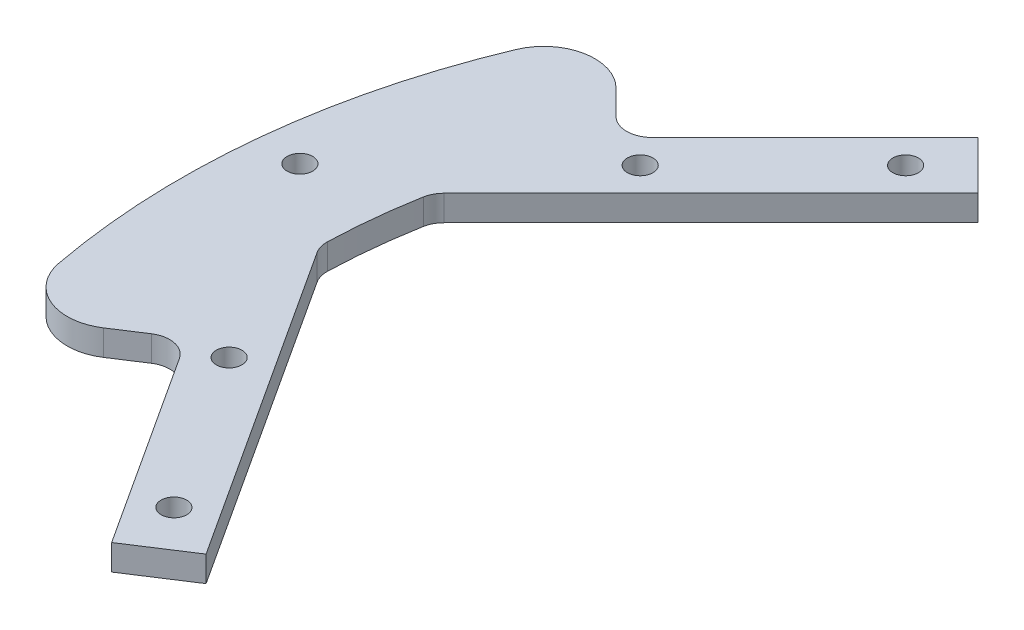
ISO-10303-21;
HEADER;
FILE_DESCRIPTION(('STEP AP214'),'2;1');
FILE_NAME('part.step','',(''),(''),'','','');
FILE_SCHEMA(('AUTOMOTIVE_DESIGN { 1 0 10303 214 1 1 1 1 }'));
ENDSEC;
DATA;
#1=APPLICATION_CONTEXT('core data for automotive mechanical design processes');
#2=APPLICATION_PROTOCOL_DEFINITION('international standard','automotive_design',2000,#1);
#3=PRODUCT_CONTEXT('',#1,'mechanical');
#4=PRODUCT('Part','Part','',(#3));
#5=PRODUCT_RELATED_PRODUCT_CATEGORY('part','',(#4));
#6=PRODUCT_DEFINITION_FORMATION('','',#4);
#7=PRODUCT_DEFINITION_CONTEXT('part definition',#1,'design');
#8=PRODUCT_DEFINITION('design','',#6,#7);
#9=PRODUCT_DEFINITION_SHAPE('','',#8);
#10=(LENGTH_UNIT() NAMED_UNIT(*) SI_UNIT(.MILLI.,.METRE.));
#11=(NAMED_UNIT(*) PLANE_ANGLE_UNIT() SI_UNIT($,.RADIAN.));
#12=(NAMED_UNIT(*) SI_UNIT($,.STERADIAN.) SOLID_ANGLE_UNIT());
#13=UNCERTAINTY_MEASURE_WITH_UNIT(LENGTH_MEASURE(1.E-05),#10,'distance_accuracy_value','');
#14=(GEOMETRIC_REPRESENTATION_CONTEXT(3) GLOBAL_UNCERTAINTY_ASSIGNED_CONTEXT((#13)) GLOBAL_UNIT_ASSIGNED_CONTEXT((#10,
#11,#12)) REPRESENTATION_CONTEXT('',''));
#15=CARTESIAN_POINT('',(0.,0.,0.));
#16=DIRECTION('',(0.,0.,1.));
#17=DIRECTION('',(1.,0.,0.));
#18=AXIS2_PLACEMENT_3D('',#15,#16,#17);
#19=CARTESIAN_POINT('',(0.,3.,0.));
#20=DIRECTION('',(0.,1.,0.));
#21=DIRECTION('',(0.,0.,1.));
#22=AXIS2_PLACEMENT_3D('',#19,#20,#21);
#23=PLANE('',#22);
#24=CARTESIAN_POINT('',(-79.5,3.,-8.5));
#25=DIRECTION('',(0.,1.,0.));
#26=DIRECTION('',(0.,0.,1.));
#27=AXIS2_PLACEMENT_3D('',#24,#25,#26);
#28=CIRCLE('',#27,1.5);
#29=CARTESIAN_POINT('',(-79.5,3.,-7.));
#30=VERTEX_POINT('',#29);
#31=EDGE_CURVE('E547',#30,#30,#28,.T.);
#32=ORIENTED_EDGE('',*,*,#31,.F.);
#33=EDGE_LOOP('',(#32));
#34=FACE_BOUND('',#33,.T.);
#35=CARTESIAN_POINT('',(-51.9975752126165,3.,33.7676201709314));
#36=DIRECTION('',(0.,1.,0.));
#37=DIRECTION('',(0.,0.,1.));
#38=AXIS2_PLACEMENT_3D('',#35,#36,#37);
#39=CIRCLE('',#38,1.5);
#40=CARTESIAN_POINT('',(-51.9975752126165,3.,35.2676201709314));
#41=VERTEX_POINT('',#40);
#42=EDGE_CURVE('E530',#41,#41,#39,.T.);
#43=ORIENTED_EDGE('',*,*,#42,.F.);
#44=EDGE_LOOP('',(#43));
#45=FACE_BOUND('',#44,.T.);
#46=CARTESIAN_POINT('',(-43.8406204335662,3.,-43.8406204335657));
#47=DIRECTION('',(0.,1.,0.));
#48=DIRECTION('',(0.,0.,1.));
#49=AXIS2_PLACEMENT_3D('',#46,#47,#48);
#50=CIRCLE('',#49,1.5);
#51=CARTESIAN_POINT('',(-43.8406204335662,3.,-42.3406204335657));
#52=VERTEX_POINT('',#51);
#53=EDGE_CURVE('E191',#52,#52,#50,.T.);
#54=ORIENTED_EDGE('',*,*,#53,.F.);
#55=EDGE_LOOP('',(#54));
#56=FACE_BOUND('',#55,.T.);
#57=DIRECTION('',(-0.707106781186544,0.,0.707106781186551));
#58=VECTOR('',#57,1.);
#59=CARTESIAN_POINT('',(-63.6396103067894,3.,-29.6984848098347));
#60=LINE('',#59,#58);
#61=CARTESIAN_POINT('',(-42.4264068711931,3.,-50.9116882454312));
#62=VERTEX_POINT('',#61);
#63=CARTESIAN_POINT('',(-61.5182899632298,3.,-31.8198051533943));
#64=VERTEX_POINT('',#63);
#65=EDGE_CURVE('E182',#62,#64,#60,.T.);
#66=ORIENTED_EDGE('',*,*,#65,.T.);
#67=CARTESIAN_POINT('',(-63.6396103067894,3.,-33.941125496954));
#68=DIRECTION('',(0.,1.,0.));
#69=DIRECTION('',(0.,0.,1.));
#70=AXIS2_PLACEMENT_3D('',#67,#68,#69);
#71=CIRCLE('',#70,3.);
#72=CARTESIAN_POINT('',(-65.7609306503491,3.,-31.8198051533943));
#73=VERTEX_POINT('',#72);
#74=EDGE_CURVE('E265',#64,#73,#71,.F.);
#75=ORIENTED_EDGE('',*,*,#74,.T.);
#76=DIRECTION('',(-0.707106781186552,0.,-0.707106781186543));
#77=VECTOR('',#76,1.);
#78=CARTESIAN_POINT('',(-74.6290400089809,3.,-40.687914512026));
#79=LINE('',#78,#77);
#80=CARTESIAN_POINT('',(-68.6474434592942,3.,-34.7063179623394));
#81=VERTEX_POINT('',#80);
#82=EDGE_CURVE('E184',#73,#81,#79,.T.);
#83=ORIENTED_EDGE('',*,*,#82,.T.);
#84=CARTESIAN_POINT('',(-72.8900841464135,3.,-30.4636772752201));
#85=DIRECTION('',(0.,1.,0.));
#86=DIRECTION('',(0.,0.,1.));
#87=AXIS2_PLACEMENT_3D('',#84,#85,#86);
#88=CIRCLE('',#87,6.);
#89=CARTESIAN_POINT('',(-78.4260399043689,3.,-32.7773742834647));
#90=VERTEX_POINT('',#89);
#91=EDGE_CURVE('E232',#81,#90,#88,.T.);
#92=ORIENTED_EDGE('',*,*,#91,.T.);
#93=CARTESIAN_POINT('',(0.,3.,0.));
#94=DIRECTION('',(0.,1.,0.));
#95=DIRECTION('',(0.,0.,1.));
#96=AXIS2_PLACEMENT_3D('',#93,#94,#95);
#97=CIRCLE('',#96,85.);
#98=CARTESIAN_POINT('',(-83.5270420753539,3.,15.7554194530665));
#99=VERTEX_POINT('',#98);
#100=EDGE_CURVE('E211',#90,#99,#97,.T.);
#101=ORIENTED_EDGE('',*,*,#100,.T.);
#102=CARTESIAN_POINT('',(-77.6310155759171,3.,14.6432721975559));
#103=DIRECTION('',(0.,1.,0.));
#104=DIRECTION('',(0.,0.,1.));
#105=AXIS2_PLACEMENT_3D('',#102,#103,#104);
#106=CIRCLE('',#105,6.);
#107=CARTESIAN_POINT('',(-74.363181365827,3.,19.6752956052285));
#108=VERTEX_POINT('',#107);
#109=EDGE_CURVE('E230',#99,#108,#106,.T.);
#110=ORIENTED_EDGE('',*,*,#109,.T.);
#111=DIRECTION('',(0.838670567945427,0.,-0.544639035015022));
#112=VECTOR('',#111,1.);
#113=CARTESIAN_POINT('',(-68.4235943247587,3.,15.8180826803013));
#114=LINE('',#113,#112);
#115=CARTESIAN_POINT('',(-70.939606028595,3.,17.4519997853463));
#116=VERTEX_POINT('',#115);
#117=EDGE_CURVE('E156',#108,#116,#114,.T.);
#118=ORIENTED_EDGE('',*,*,#117,.T.);
#119=CARTESIAN_POINT('',(-69.3056889235499,3.,19.9680114891826));
#120=DIRECTION('',(0.,1.,0.));
#121=DIRECTION('',(0.,0.,1.));
#122=AXIS2_PLACEMENT_3D('',#119,#120,#121);
#123=CIRCLE('',#122,3.);
#124=CARTESIAN_POINT('',(-66.7896772197137,3.,18.3340943841376));
#125=VERTEX_POINT('',#124);
#126=EDGE_CURVE('E11',#116,#125,#123,.F.);
#127=ORIENTED_EDGE('',*,*,#126,.T.);
#128=DIRECTION('',(0.544639035015023,0.,0.838670567945427));
#129=VECTOR('',#128,1.);
#130=CARTESIAN_POINT('',(-52.0844232743081,3.,40.978199718664));
#131=LINE('',#130,#129);
#132=CARTESIAN_POINT('',(-52.0844232743081,3.,40.978199718664));
#133=VERTEX_POINT('',#132);
#134=EDGE_CURVE('E144',#125,#133,#131,.T.);
#135=ORIENTED_EDGE('',*,*,#134,.T.);
#136=DIRECTION('',(0.838670567945427,0.,-0.544639035015022));
#137=VECTOR('',#136,1.);
#138=CARTESIAN_POINT('',(-45.3750587307446,3.,36.6210874385439));
#139=LINE('',#138,#137);
#140=CARTESIAN_POINT('',(-45.3750587307446,3.,36.6210874385439));
#141=VERTEX_POINT('',#140);
#142=EDGE_CURVE('E150',#133,#141,#139,.T.);
#143=ORIENTED_EDGE('',*,*,#142,.T.);
#144=DIRECTION('',(-0.544639035015023,0.,-0.838670567945426));
#145=VECTOR('',#144,1.);
#146=CARTESIAN_POINT('',(-69.9882966174528,3.,-1.27997522923208));
#147=LINE('',#146,#145);
#148=CARTESIAN_POINT('',(-69.4820094592601,3.,-0.500361372701859));
#149=VERTEX_POINT('',#148);
#150=EDGE_CURVE('E170',#141,#149,#147,.T.);
#151=ORIENTED_EDGE('',*,*,#150,.T.);
#152=CARTESIAN_POINT('',(-66.9659977554238,3.,-2.13427847774693));
#153=DIRECTION('',(0.,1.,0.));
#154=DIRECTION('',(0.,0.,1.));
#155=AXIS2_PLACEMENT_3D('',#152,#153,#154);
#156=CIRCLE('',#155,3.);
#157=CARTESIAN_POINT('',(-69.9644752668607,3.,-2.22984318570574));
#158=VERTEX_POINT('',#157);
#159=EDGE_CURVE('E257',#149,#158,#156,.F.);
#160=ORIENTED_EDGE('',*,*,#159,.T.);
#161=CARTESIAN_POINT('',(0.,3.,0.));
#162=DIRECTION('',(0.,-1.,0.));
#163=DIRECTION('',(0.,0.,1.));
#164=AXIS2_PLACEMENT_3D('',#161,#162,#163);
#165=CIRCLE('',#164,70.);
#166=CARTESIAN_POINT('',(-68.899194085878,3.,-12.3653165877995));
#167=VERTEX_POINT('',#166);
#168=EDGE_CURVE('E172',#158,#167,#165,.T.);
#169=ORIENTED_EDGE('',*,*,#168,.T.);
#170=CARTESIAN_POINT('',(-65.9463714821975,3.,-11.8353744483224));
#171=DIRECTION('',(0.,1.,0.));
#172=DIRECTION('',(0.,0.,1.));
#173=AXIS2_PLACEMENT_3D('',#170,#171,#172);
#174=CIRCLE('',#173,3.);
#175=CARTESIAN_POINT('',(-68.0676918257572,3.,-13.956694791882));
#176=VERTEX_POINT('',#175);
#177=EDGE_CURVE('E261',#167,#176,#174,.F.);
#178=ORIENTED_EDGE('',*,*,#177,.T.);
#179=DIRECTION('',(0.707106781186543,0.,-0.707106781186551));
#180=VECTOR('',#179,1.);
#181=CARTESIAN_POINT('',(-36.7695526217007,3.,-45.2548339959388));
#182=LINE('',#181,#180);
#183=CARTESIAN_POINT('',(-36.7695526217007,3.,-45.2548339959388));
#184=VERTEX_POINT('',#183);
#185=EDGE_CURVE('E178',#176,#184,#182,.T.);
#186=ORIENTED_EDGE('',*,*,#185,.T.);
#187=DIRECTION('',(-0.707106781186551,0.,-0.707106781186544));
#188=VECTOR('',#187,1.);
#189=CARTESIAN_POINT('',(-42.4264068711931,3.,-50.9116882454312));
#190=LINE('',#189,#188);
#191=EDGE_CURVE('E180',#184,#62,#190,.T.);
#192=ORIENTED_EDGE('',*,*,#191,.T.);
#193=EDGE_LOOP('',(#66,#75,#83,#92,#101,#110,#118,#127,#135,#143,#151,#160,#169,#178,#186,#192));
#194=FACE_BOUND('',#193,.T.);
#195=CARTESIAN_POINT('',(-59.3969696196702,3.,-28.2842712474616));
#196=DIRECTION('',(0.,1.,0.));
#197=DIRECTION('',(0.,0.,1.));
#198=AXIS2_PLACEMENT_3D('',#195,#196,#197);
#199=CIRCLE('',#198,1.5);
#200=CARTESIAN_POINT('',(-59.3969696196702,3.,-26.7842712474616));
#201=VERTEX_POINT('',#200);
#202=EDGE_CURVE('E524',#201,#201,#199,.T.);
#203=ORIENTED_EDGE('',*,*,#202,.F.);
#204=EDGE_LOOP('',(#203));
#205=FACE_BOUND('',#204,.T.);
#206=CARTESIAN_POINT('',(-63.979633982947,3.,15.316867676132));
#207=DIRECTION('',(0.,1.,0.));
#208=DIRECTION('',(0.,0.,1.));
#209=AXIS2_PLACEMENT_3D('',#206,#207,#208);
#210=CIRCLE('',#209,1.5);
#211=CARTESIAN_POINT('',(-63.979633982947,3.,16.816867676132));
#212=VERTEX_POINT('',#211);
#213=EDGE_CURVE('E536',#212,#212,#210,.T.);
#214=ORIENTED_EDGE('',*,*,#213,.F.);
#215=EDGE_LOOP('',(#214));
#216=FACE_BOUND('',#215,.T.);
#217=ADVANCED_FACE('F32',(#34,#45,#56,#194,#205,#216),#23,.T.);
#218=CARTESIAN_POINT('',(0.,0.,0.));
#219=DIRECTION('',(0.,1.,0.));
#220=DIRECTION('',(0.,0.,1.));
#221=AXIS2_PLACEMENT_3D('',#218,#219,#220);
#222=PLANE('',#221);
#223=CARTESIAN_POINT('',(-79.5,0.,-8.5));
#224=DIRECTION('',(0.,1.,0.));
#225=DIRECTION('',(0.,0.,1.));
#226=AXIS2_PLACEMENT_3D('',#223,#224,#225);
#227=CIRCLE('',#226,1.5);
#228=CARTESIAN_POINT('',(-79.5,0.,-7.));
#229=VERTEX_POINT('',#228);
#230=EDGE_CURVE('E542',#229,#229,#227,.F.);
#231=ORIENTED_EDGE('',*,*,#230,.F.);
#232=EDGE_LOOP('',(#231));
#233=FACE_BOUND('',#232,.T.);
#234=CARTESIAN_POINT('',(-51.9975752126165,0.,33.7676201709314));
#235=DIRECTION('',(0.,1.,0.));
#236=DIRECTION('',(0.,0.,1.));
#237=AXIS2_PLACEMENT_3D('',#234,#235,#236);
#238=CIRCLE('',#237,1.5);
#239=CARTESIAN_POINT('',(-51.9975752126165,0.,35.2676201709314));
#240=VERTEX_POINT('',#239);
#241=EDGE_CURVE('E533',#240,#240,#238,.T.);
#242=ORIENTED_EDGE('',*,*,#241,.T.);
#243=EDGE_LOOP('',(#242));
#244=FACE_BOUND('',#243,.T.);
#245=CARTESIAN_POINT('',(-43.8406204335662,0.,-43.8406204335657));
#246=DIRECTION('',(0.,1.,0.));
#247=DIRECTION('',(0.,0.,1.));
#248=AXIS2_PLACEMENT_3D('',#245,#246,#247);
#249=CIRCLE('',#248,1.5);
#250=CARTESIAN_POINT('',(-43.8406204335662,0.,-42.3406204335657));
#251=VERTEX_POINT('',#250);
#252=EDGE_CURVE('E521',#251,#251,#249,.T.);
#253=ORIENTED_EDGE('',*,*,#252,.T.);
#254=EDGE_LOOP('',(#253));
#255=FACE_BOUND('',#254,.T.);
#256=CARTESIAN_POINT('',(0.,0.,0.));
#257=DIRECTION('',(0.,1.,0.));
#258=DIRECTION('',(0.,0.,1.));
#259=AXIS2_PLACEMENT_3D('',#256,#257,#258);
#260=CIRCLE('',#259,85.);
#261=CARTESIAN_POINT('',(-78.4260399043689,0.,-32.7773742834647));
#262=VERTEX_POINT('',#261);
#263=CARTESIAN_POINT('',(-83.5270420753539,0.,15.7554194530665));
#264=VERTEX_POINT('',#263);
#265=EDGE_CURVE('E187',#262,#264,#260,.T.);
#266=ORIENTED_EDGE('',*,*,#265,.F.);
#267=CARTESIAN_POINT('',(-72.8900841464135,0.,-30.4636772752201));
#268=DIRECTION('',(0.,1.,0.));
#269=DIRECTION('',(0.,0.,1.));
#270=AXIS2_PLACEMENT_3D('',#267,#268,#269);
#271=CIRCLE('',#270,6.);
#272=CARTESIAN_POINT('',(-68.6474434592942,0.,-34.7063179623394));
#273=VERTEX_POINT('',#272);
#274=EDGE_CURVE('E224',#262,#273,#271,.F.);
#275=ORIENTED_EDGE('',*,*,#274,.T.);
#276=DIRECTION('',(-0.707106781186552,0.,-0.707106781186543));
#277=VECTOR('',#276,1.);
#278=CARTESIAN_POINT('',(-74.6290400089809,0.,-40.687914512026));
#279=LINE('',#278,#277);
#280=CARTESIAN_POINT('',(-65.7609306503491,0.,-31.8198051533943));
#281=VERTEX_POINT('',#280);
#282=EDGE_CURVE('E209',#281,#273,#279,.T.);
#283=ORIENTED_EDGE('',*,*,#282,.F.);
#284=CARTESIAN_POINT('',(-63.6396103067894,0.,-33.941125496954));
#285=DIRECTION('',(0.,1.,0.));
#286=DIRECTION('',(0.,0.,1.));
#287=AXIS2_PLACEMENT_3D('',#284,#285,#286);
#288=CIRCLE('',#287,3.);
#289=CARTESIAN_POINT('',(-61.5182899632298,0.,-31.8198051533943));
#290=VERTEX_POINT('',#289);
#291=EDGE_CURVE('E263',#281,#290,#288,.T.);
#292=ORIENTED_EDGE('',*,*,#291,.T.);
#293=DIRECTION('',(-0.707106781186544,0.,0.707106781186551));
#294=VECTOR('',#293,1.);
#295=CARTESIAN_POINT('',(-63.6396103067894,0.,-29.6984848098347));
#296=LINE('',#295,#294);
#297=CARTESIAN_POINT('',(-42.4264068711931,0.,-50.9116882454312));
#298=VERTEX_POINT('',#297);
#299=EDGE_CURVE('E206',#298,#290,#296,.T.);
#300=ORIENTED_EDGE('',*,*,#299,.F.);
#301=DIRECTION('',(-0.707106781186551,0.,-0.707106781186544));
#302=VECTOR('',#301,1.);
#303=CARTESIAN_POINT('',(-42.4264068711931,0.,-50.9116882454312));
#304=LINE('',#303,#302);
#305=CARTESIAN_POINT('',(-36.7695526217007,0.,-45.2548339959388));
#306=VERTEX_POINT('',#305);
#307=EDGE_CURVE('E204',#306,#298,#304,.T.);
#308=ORIENTED_EDGE('',*,*,#307,.F.);
#309=DIRECTION('',(0.707106781186543,0.,-0.707106781186551));
#310=VECTOR('',#309,1.);
#311=CARTESIAN_POINT('',(-36.7695526217007,0.,-45.2548339959388));
#312=LINE('',#311,#310);
#313=CARTESIAN_POINT('',(-68.0676918257572,0.,-13.956694791882));
#314=VERTEX_POINT('',#313);
#315=EDGE_CURVE('E202',#314,#306,#312,.T.);
#316=ORIENTED_EDGE('',*,*,#315,.F.);
#317=CARTESIAN_POINT('',(-65.9463714821975,0.,-11.8353744483224));
#318=DIRECTION('',(0.,1.,0.));
#319=DIRECTION('',(0.,0.,1.));
#320=AXIS2_PLACEMENT_3D('',#317,#318,#319);
#321=CIRCLE('',#320,3.);
#322=CARTESIAN_POINT('',(-68.899194085878,0.,-12.3653165877995));
#323=VERTEX_POINT('',#322);
#324=EDGE_CURVE('E259',#314,#323,#321,.T.);
#325=ORIENTED_EDGE('',*,*,#324,.T.);
#326=CARTESIAN_POINT('',(0.,0.,0.));
#327=DIRECTION('',(0.,-1.,0.));
#328=DIRECTION('',(0.,0.,1.));
#329=AXIS2_PLACEMENT_3D('',#326,#327,#328);
#330=CIRCLE('',#329,70.);
#331=CARTESIAN_POINT('',(-69.9644752668607,0.,-2.22984318570574));
#332=VERTEX_POINT('',#331);
#333=EDGE_CURVE('E199',#332,#323,#330,.T.);
#334=ORIENTED_EDGE('',*,*,#333,.F.);
#335=CARTESIAN_POINT('',(-66.9659977554238,0.,-2.13427847774693));
#336=DIRECTION('',(0.,1.,0.));
#337=DIRECTION('',(0.,0.,1.));
#338=AXIS2_PLACEMENT_3D('',#335,#336,#337);
#339=CIRCLE('',#338,3.);
#340=CARTESIAN_POINT('',(-69.4820094592601,0.,-0.500361372701859));
#341=VERTEX_POINT('',#340);
#342=EDGE_CURVE('E255',#332,#341,#339,.T.);
#343=ORIENTED_EDGE('',*,*,#342,.T.);
#344=DIRECTION('',(-0.544639035015023,0.,-0.838670567945426));
#345=VECTOR('',#344,1.);
#346=CARTESIAN_POINT('',(-69.9882966174528,0.,-1.27997522923208));
#347=LINE('',#346,#345);
#348=CARTESIAN_POINT('',(-45.3750587307446,0.,36.6210874385439));
#349=VERTEX_POINT('',#348);
#350=EDGE_CURVE('E196',#349,#341,#347,.T.);
#351=ORIENTED_EDGE('',*,*,#350,.F.);
#352=DIRECTION('',(0.838670567945427,0.,-0.544639035015022));
#353=VECTOR('',#352,1.);
#354=CARTESIAN_POINT('',(-45.3750587307446,0.,36.6210874385439));
#355=LINE('',#354,#353);
#356=CARTESIAN_POINT('',(-52.0844232743081,0.,40.978199718664));
#357=VERTEX_POINT('',#356);
#358=EDGE_CURVE('E194',#357,#349,#355,.T.);
#359=ORIENTED_EDGE('',*,*,#358,.F.);
#360=DIRECTION('',(0.544639035015023,0.,0.838670567945427));
#361=VECTOR('',#360,1.);
#362=CARTESIAN_POINT('',(-52.0844232743081,0.,40.978199718664));
#363=LINE('',#362,#361);
#364=CARTESIAN_POINT('',(-66.7896772197137,0.,18.3340943841376));
#365=VERTEX_POINT('',#364);
#366=EDGE_CURVE('E161',#365,#357,#363,.T.);
#367=ORIENTED_EDGE('',*,*,#366,.F.);
#368=CARTESIAN_POINT('',(-69.3056889235499,0.,19.9680114891826));
#369=DIRECTION('',(0.,1.,0.));
#370=DIRECTION('',(0.,0.,1.));
#371=AXIS2_PLACEMENT_3D('',#368,#369,#370);
#372=CIRCLE('',#371,3.);
#373=CARTESIAN_POINT('',(-70.939606028595,0.,17.4519997853463));
#374=VERTEX_POINT('',#373);
#375=EDGE_CURVE('E40',#365,#374,#372,.T.);
#376=ORIENTED_EDGE('',*,*,#375,.T.);
#377=DIRECTION('',(0.838670567945427,0.,-0.544639035015022));
#378=VECTOR('',#377,1.);
#379=CARTESIAN_POINT('',(-68.4235943247587,0.,15.8180826803013));
#380=LINE('',#379,#378);
#381=CARTESIAN_POINT('',(-74.363181365827,0.,19.6752956052285));
#382=VERTEX_POINT('',#381);
#383=EDGE_CURVE('E190',#382,#374,#380,.T.);
#384=ORIENTED_EDGE('',*,*,#383,.F.);
#385=CARTESIAN_POINT('',(-77.6310155759171,0.,14.6432721975559));
#386=DIRECTION('',(0.,1.,0.));
#387=DIRECTION('',(0.,0.,1.));
#388=AXIS2_PLACEMENT_3D('',#385,#386,#387);
#389=CIRCLE('',#388,6.);
#390=EDGE_CURVE('E222',#382,#264,#389,.F.);
#391=ORIENTED_EDGE('',*,*,#390,.T.);
#392=EDGE_LOOP('',(#266,#275,#283,#292,#300,#308,#316,#325,#334,#343,#351,#359,#367,#376,#384,#391));
#393=FACE_BOUND('',#392,.T.);
#394=CARTESIAN_POINT('',(-59.3969696196702,0.,-28.2842712474616));
#395=DIRECTION('',(0.,1.,0.));
#396=DIRECTION('',(0.,0.,1.));
#397=AXIS2_PLACEMENT_3D('',#394,#395,#396);
#398=CIRCLE('',#397,1.5);
#399=CARTESIAN_POINT('',(-59.3969696196702,0.,-26.7842712474616));
#400=VERTEX_POINT('',#399);
#401=EDGE_CURVE('E527',#400,#400,#398,.T.);
#402=ORIENTED_EDGE('',*,*,#401,.T.);
#403=EDGE_LOOP('',(#402));
#404=FACE_BOUND('',#403,.T.);
#405=CARTESIAN_POINT('',(-63.979633982947,0.,15.316867676132));
#406=DIRECTION('',(0.,1.,0.));
#407=DIRECTION('',(0.,0.,1.));
#408=AXIS2_PLACEMENT_3D('',#405,#406,#407);
#409=CIRCLE('',#408,1.5);
#410=CARTESIAN_POINT('',(-63.979633982947,0.,16.816867676132));
#411=VERTEX_POINT('',#410);
#412=EDGE_CURVE('E539',#411,#411,#409,.T.);
#413=ORIENTED_EDGE('',*,*,#412,.T.);
#414=EDGE_LOOP('',(#413));
#415=FACE_BOUND('',#414,.T.);
#416=ADVANCED_FACE('F280',(#233,#244,#255,#393,#404,#415),#222,.F.);
#417=CARTESIAN_POINT('',(0.,3.,0.));
#418=DIRECTION('',(0.,-1.,0.));
#419=DIRECTION('',(0.,0.,-1.));
#420=AXIS2_PLACEMENT_3D('',#417,#418,#419);
#421=CYLINDRICAL_SURFACE('',#420,85.);
#422=ORIENTED_EDGE('',*,*,#100,.F.);
#423=DIRECTION('',(0.,-1.,0.));
#424=VECTOR('',#423,1.);
#425=CARTESIAN_POINT('',(-78.426039904369,3.,-32.7773742834647));
#426=LINE('',#425,#424);
#427=EDGE_CURVE('E219',#90,#262,#426,.T.);
#428=ORIENTED_EDGE('',*,*,#427,.T.);
#429=ORIENTED_EDGE('',*,*,#265,.T.);
#430=DIRECTION('',(0.,-1.,0.));
#431=VECTOR('',#430,1.);
#432=CARTESIAN_POINT('',(-83.5270420753539,3.,15.7554194530665));
#433=LINE('',#432,#431);
#434=EDGE_CURVE('E164',#264,#99,#433,.F.);
#435=ORIENTED_EDGE('',*,*,#434,.T.);
#436=EDGE_LOOP('',(#422,#428,#429,#435));
#437=FACE_BOUND('',#436,.T.);
#438=ADVANCED_FACE('F326',(#437),#421,.T.);
#439=CARTESIAN_POINT('',(-68.4235943247587,3.,15.8180826803013));
#440=DIRECTION('',(-0.544639035015022,0.,-0.838670567945427));
#441=DIRECTION('',(-0.838670567945427,0.,0.544639035015022));
#442=AXIS2_PLACEMENT_3D('',#439,#440,#441);
#443=PLANE('',#442);
#444=ORIENTED_EDGE('',*,*,#383,.T.);
#445=DIRECTION('',(0.,-1.,0.));
#446=VECTOR('',#445,1.);
#447=CARTESIAN_POINT('',(-70.939606028595,3.,17.4519997853463));
#448=LINE('',#447,#446);
#449=EDGE_CURVE('E53',#374,#116,#448,.F.);
#450=ORIENTED_EDGE('',*,*,#449,.T.);
#451=ORIENTED_EDGE('',*,*,#117,.F.);
#452=DIRECTION('',(0.,-1.,0.));
#453=VECTOR('',#452,1.);
#454=CARTESIAN_POINT('',(-74.363181365827,3.,19.6752956052285));
#455=LINE('',#454,#453);
#456=EDGE_CURVE('E234',#108,#382,#455,.T.);
#457=ORIENTED_EDGE('',*,*,#456,.T.);
#458=EDGE_LOOP('',(#444,#450,#451,#457));
#459=FACE_BOUND('',#458,.T.);
#460=ADVANCED_FACE('F452',(#459),#443,.F.);
#461=CARTESIAN_POINT('',(-52.0844232743081,3.,40.978199718664));
#462=DIRECTION('',(0.838670567945427,0.,-0.544639035015023));
#463=DIRECTION('',(-0.544639035015023,0.,-0.838670567945427));
#464=AXIS2_PLACEMENT_3D('',#461,#462,#463);
#465=PLANE('',#464);
#466=ORIENTED_EDGE('',*,*,#134,.F.);
#467=DIRECTION('',(0.,-1.,0.));
#468=VECTOR('',#467,1.);
#469=CARTESIAN_POINT('',(-66.7896772197137,0.,18.3340943841376));
#470=LINE('',#469,#468);
#471=EDGE_CURVE('E252',#125,#365,#470,.T.);
#472=ORIENTED_EDGE('',*,*,#471,.T.);
#473=ORIENTED_EDGE('',*,*,#366,.T.);
#474=DIRECTION('',(0.,-1.,0.));
#475=VECTOR('',#474,1.);
#476=CARTESIAN_POINT('',(-52.0844232743081,3.,40.978199718664));
#477=LINE('',#476,#475);
#478=EDGE_CURVE('E159',#133,#357,#477,.T.);
#479=ORIENTED_EDGE('',*,*,#478,.F.);
#480=EDGE_LOOP('',(#466,#472,#473,#479));
#481=FACE_BOUND('',#480,.T.);
#482=ADVANCED_FACE('F160',(#481),#465,.F.);
#483=CARTESIAN_POINT('',(-45.3750587307446,3.,36.6210874385439));
#484=DIRECTION('',(-0.544639035015022,0.,-0.838670567945427));
#485=DIRECTION('',(-0.838670567945427,0.,0.544639035015022));
#486=AXIS2_PLACEMENT_3D('',#483,#484,#485);
#487=PLANE('',#486);
#488=ORIENTED_EDGE('',*,*,#358,.T.);
#489=DIRECTION('',(0.,-1.,0.));
#490=VECTOR('',#489,1.);
#491=CARTESIAN_POINT('',(-45.3750587307446,3.,36.6210874385439));
#492=LINE('',#491,#490);
#493=EDGE_CURVE('E165',#141,#349,#492,.T.);
#494=ORIENTED_EDGE('',*,*,#493,.F.);
#495=ORIENTED_EDGE('',*,*,#142,.F.);
#496=ORIENTED_EDGE('',*,*,#478,.T.);
#497=EDGE_LOOP('',(#488,#494,#495,#496));
#498=FACE_BOUND('',#497,.T.);
#499=ADVANCED_FACE('F167',(#498),#487,.F.);
#500=CARTESIAN_POINT('',(-69.9882966174528,3.,-1.27997522923208));
#501=DIRECTION('',(-0.838670567945426,0.,0.544639035015023));
#502=DIRECTION('',(0.544639035015023,0.,0.838670567945426));
#503=AXIS2_PLACEMENT_3D('',#500,#501,#502);
#504=PLANE('',#503);
#505=ORIENTED_EDGE('',*,*,#350,.T.);
#506=DIRECTION('',(0.,1.,0.));
#507=VECTOR('',#506,1.);
#508=CARTESIAN_POINT('',(-69.4820094592601,3.,-0.50036137270186));
#509=LINE('',#508,#507);
#510=EDGE_CURVE('E242',#341,#149,#509,.T.);
#511=ORIENTED_EDGE('',*,*,#510,.T.);
#512=ORIENTED_EDGE('',*,*,#150,.F.);
#513=ORIENTED_EDGE('',*,*,#493,.T.);
#514=EDGE_LOOP('',(#505,#511,#512,#513));
#515=FACE_BOUND('',#514,.T.);
#516=ADVANCED_FACE('F310',(#515),#504,.F.);
#517=CARTESIAN_POINT('',(0.,3.,0.));
#518=DIRECTION('',(0.,-1.,0.));
#519=DIRECTION('',(0.,0.,-1.));
#520=AXIS2_PLACEMENT_3D('',#517,#518,#519);
#521=CYLINDRICAL_SURFACE('',#520,70.);
#522=ORIENTED_EDGE('',*,*,#168,.F.);
#523=DIRECTION('',(0.,-1.,0.));
#524=VECTOR('',#523,1.);
#525=CARTESIAN_POINT('',(-69.9644752668607,3.,-2.22984318570574));
#526=LINE('',#525,#524);
#527=EDGE_CURVE('E239',#158,#332,#526,.T.);
#528=ORIENTED_EDGE('',*,*,#527,.T.);
#529=ORIENTED_EDGE('',*,*,#333,.T.);
#530=DIRECTION('',(0.,-1.,0.));
#531=VECTOR('',#530,1.);
#532=CARTESIAN_POINT('',(-68.8991940858781,3.,-12.3653165877995));
#533=LINE('',#532,#531);
#534=EDGE_CURVE('E237',#323,#167,#533,.F.);
#535=ORIENTED_EDGE('',*,*,#534,.T.);
#536=EDGE_LOOP('',(#522,#528,#529,#535));
#537=FACE_BOUND('',#536,.T.);
#538=ADVANCED_FACE('F302',(#537),#521,.F.);
#539=CARTESIAN_POINT('',(-36.7695526217007,3.,-45.2548339959388));
#540=DIRECTION('',(-0.707106781186552,0.,-0.707106781186543));
#541=DIRECTION('',(-0.707106781186543,0.,0.707106781186552));
#542=AXIS2_PLACEMENT_3D('',#539,#540,#541);
#543=PLANE('',#542);
#544=ORIENTED_EDGE('',*,*,#185,.F.);
#545=DIRECTION('',(0.,1.,0.));
#546=VECTOR('',#545,1.);
#547=CARTESIAN_POINT('',(-68.0676918257572,0.,-13.956694791882));
#548=LINE('',#547,#546);
#549=EDGE_CURVE('E244',#176,#314,#548,.F.);
#550=ORIENTED_EDGE('',*,*,#549,.T.);
#551=ORIENTED_EDGE('',*,*,#315,.T.);
#552=DIRECTION('',(0.,-1.,0.));
#553=VECTOR('',#552,1.);
#554=CARTESIAN_POINT('',(-36.7695526217007,3.,-45.2548339959388));
#555=LINE('',#554,#553);
#556=EDGE_CURVE('E214',#184,#306,#555,.T.);
#557=ORIENTED_EDGE('',*,*,#556,.F.);
#558=EDGE_LOOP('',(#544,#550,#551,#557));
#559=FACE_BOUND('',#558,.T.);
#560=ADVANCED_FACE('F294',(#559),#543,.F.);
#561=CARTESIAN_POINT('',(-42.4264068711931,3.,-50.9116882454312));
#562=DIRECTION('',(-0.707106781186544,0.,0.707106781186551));
#563=DIRECTION('',(0.707106781186551,0.,0.707106781186544));
#564=AXIS2_PLACEMENT_3D('',#561,#562,#563);
#565=PLANE('',#564);
#566=ORIENTED_EDGE('',*,*,#307,.T.);
#567=DIRECTION('',(0.,-1.,0.));
#568=VECTOR('',#567,1.);
#569=CARTESIAN_POINT('',(-42.4264068711931,3.,-50.9116882454312));
#570=LINE('',#569,#568);
#571=EDGE_CURVE('E186',#62,#298,#570,.T.);
#572=ORIENTED_EDGE('',*,*,#571,.F.);
#573=ORIENTED_EDGE('',*,*,#191,.F.);
#574=ORIENTED_EDGE('',*,*,#556,.T.);
#575=EDGE_LOOP('',(#566,#572,#573,#574));
#576=FACE_BOUND('',#575,.T.);
#577=ADVANCED_FACE('F288',(#576),#565,.F.);
#578=CARTESIAN_POINT('',(-63.6396103067894,3.,-29.6984848098347));
#579=DIRECTION('',(0.707106781186551,0.,0.707106781186544));
#580=DIRECTION('',(0.707106781186544,0.,-0.707106781186551));
#581=AXIS2_PLACEMENT_3D('',#578,#579,#580);
#582=PLANE('',#581);
#583=ORIENTED_EDGE('',*,*,#299,.T.);
#584=DIRECTION('',(0.,-1.,0.));
#585=VECTOR('',#584,1.);
#586=CARTESIAN_POINT('',(-61.5182899632298,3.,-31.8198051533943));
#587=LINE('',#586,#585);
#588=EDGE_CURVE('E250',#290,#64,#587,.F.);
#589=ORIENTED_EDGE('',*,*,#588,.T.);
#590=ORIENTED_EDGE('',*,*,#65,.F.);
#591=ORIENTED_EDGE('',*,*,#571,.T.);
#592=EDGE_LOOP('',(#583,#589,#590,#591));
#593=FACE_BOUND('',#592,.T.);
#594=ADVANCED_FACE('F284',(#593),#582,.F.);
#595=CARTESIAN_POINT('',(-74.6290400089809,3.,-40.687914512026));
#596=DIRECTION('',(-0.707106781186543,0.,0.707106781186552));
#597=DIRECTION('',(0.707106781186552,0.,0.707106781186543));
#598=AXIS2_PLACEMENT_3D('',#595,#596,#597);
#599=PLANE('',#598);
#600=ORIENTED_EDGE('',*,*,#82,.F.);
#601=DIRECTION('',(0.,-1.,0.));
#602=VECTOR('',#601,1.);
#603=CARTESIAN_POINT('',(-65.7609306503491,0.,-31.8198051533943));
#604=LINE('',#603,#602);
#605=EDGE_CURVE('E247',#73,#281,#604,.T.);
#606=ORIENTED_EDGE('',*,*,#605,.T.);
#607=ORIENTED_EDGE('',*,*,#282,.T.);
#608=DIRECTION('',(0.,-1.,0.));
#609=VECTOR('',#608,1.);
#610=CARTESIAN_POINT('',(-68.6474434592942,3.,-34.7063179623394));
#611=LINE('',#610,#609);
#612=EDGE_CURVE('E227',#273,#81,#611,.F.);
#613=ORIENTED_EDGE('',*,*,#612,.T.);
#614=EDGE_LOOP('',(#600,#606,#607,#613));
#615=FACE_BOUND('',#614,.T.);
#616=ADVANCED_FACE('F273',(#615),#599,.F.);
#617=CARTESIAN_POINT('',(-43.8406204335662,3.,-43.8406204335657));
#618=DIRECTION('',(0.,-1.,0.));
#619=DIRECTION('',(0.,0.,-1.));
#620=AXIS2_PLACEMENT_3D('',#617,#618,#619);
#621=CYLINDRICAL_SURFACE('',#620,1.5);
#622=ORIENTED_EDGE('',*,*,#53,.T.);
#623=EDGE_LOOP('',(#622));
#624=FACE_BOUND('',#623,.T.);
#625=ORIENTED_EDGE('',*,*,#252,.F.);
#626=EDGE_LOOP('',(#625));
#627=FACE_BOUND('',#626,.T.);
#628=ADVANCED_FACE('F332',(#624,#627),#621,.F.);
#629=CARTESIAN_POINT('',(-59.3969696196702,3.,-28.2842712474616));
#630=DIRECTION('',(0.,-1.,0.));
#631=DIRECTION('',(0.,0.,-1.));
#632=AXIS2_PLACEMENT_3D('',#629,#630,#631);
#633=CYLINDRICAL_SURFACE('',#632,1.5);
#634=ORIENTED_EDGE('',*,*,#202,.T.);
#635=EDGE_LOOP('',(#634));
#636=FACE_BOUND('',#635,.T.);
#637=ORIENTED_EDGE('',*,*,#401,.F.);
#638=EDGE_LOOP('',(#637));
#639=FACE_BOUND('',#638,.T.);
#640=ADVANCED_FACE('F366',(#636,#639),#633,.F.);
#641=CARTESIAN_POINT('',(-51.9975752126165,3.,33.7676201709314));
#642=DIRECTION('',(0.,-1.,0.));
#643=DIRECTION('',(0.,0.,-1.));
#644=AXIS2_PLACEMENT_3D('',#641,#642,#643);
#645=CYLINDRICAL_SURFACE('',#644,1.5);
#646=ORIENTED_EDGE('',*,*,#42,.T.);
#647=EDGE_LOOP('',(#646));
#648=FACE_BOUND('',#647,.T.);
#649=ORIENTED_EDGE('',*,*,#241,.F.);
#650=EDGE_LOOP('',(#649));
#651=FACE_BOUND('',#650,.T.);
#652=ADVANCED_FACE('F373',(#648,#651),#645,.F.);
#653=CARTESIAN_POINT('',(-63.979633982947,3.,15.316867676132));
#654=DIRECTION('',(0.,-1.,0.));
#655=DIRECTION('',(0.,0.,-1.));
#656=AXIS2_PLACEMENT_3D('',#653,#654,#655);
#657=CYLINDRICAL_SURFACE('',#656,1.5);
#658=ORIENTED_EDGE('',*,*,#213,.T.);
#659=EDGE_LOOP('',(#658));
#660=FACE_BOUND('',#659,.T.);
#661=ORIENTED_EDGE('',*,*,#412,.F.);
#662=EDGE_LOOP('',(#661));
#663=FACE_BOUND('',#662,.T.);
#664=ADVANCED_FACE('F380',(#660,#663),#657,.F.);
#665=CARTESIAN_POINT('',(-72.8900841464135,3.,-30.4636772752201));
#666=DIRECTION('',(0.,-1.,0.));
#667=DIRECTION('',(0.,0.,-1.));
#668=AXIS2_PLACEMENT_3D('',#665,#666,#667);
#669=CYLINDRICAL_SURFACE('',#668,6.);
#670=ORIENTED_EDGE('',*,*,#91,.F.);
#671=ORIENTED_EDGE('',*,*,#612,.F.);
#672=ORIENTED_EDGE('',*,*,#274,.F.);
#673=ORIENTED_EDGE('',*,*,#427,.F.);
#674=EDGE_LOOP('',(#670,#671,#672,#673));
#675=FACE_BOUND('',#674,.T.);
#676=ADVANCED_FACE('F388',(#675),#669,.T.);
#677=CARTESIAN_POINT('',(-77.6310155759171,3.,14.6432721975559));
#678=DIRECTION('',(0.,-1.,0.));
#679=DIRECTION('',(0.,0.,-1.));
#680=AXIS2_PLACEMENT_3D('',#677,#678,#679);
#681=CYLINDRICAL_SURFACE('',#680,6.);
#682=ORIENTED_EDGE('',*,*,#109,.F.);
#683=ORIENTED_EDGE('',*,*,#434,.F.);
#684=ORIENTED_EDGE('',*,*,#390,.F.);
#685=ORIENTED_EDGE('',*,*,#456,.F.);
#686=EDGE_LOOP('',(#682,#683,#684,#685));
#687=FACE_BOUND('',#686,.T.);
#688=ADVANCED_FACE('F397',(#687),#681,.T.);
#689=CARTESIAN_POINT('',(-66.9659977554238,3.,-2.13427847774693));
#690=DIRECTION('',(0.,-1.,0.));
#691=DIRECTION('',(0.,0.,-1.));
#692=AXIS2_PLACEMENT_3D('',#689,#690,#691);
#693=CYLINDRICAL_SURFACE('',#692,3.);
#694=ORIENTED_EDGE('',*,*,#159,.F.);
#695=ORIENTED_EDGE('',*,*,#510,.F.);
#696=ORIENTED_EDGE('',*,*,#342,.F.);
#697=ORIENTED_EDGE('',*,*,#527,.F.);
#698=EDGE_LOOP('',(#694,#695,#696,#697));
#699=FACE_BOUND('',#698,.T.);
#700=ADVANCED_FACE('F307',(#699),#693,.F.);
#701=CARTESIAN_POINT('',(-65.9463714821975,3.,-11.8353744483224));
#702=DIRECTION('',(0.,-1.,0.));
#703=DIRECTION('',(0.,0.,-1.));
#704=AXIS2_PLACEMENT_3D('',#701,#702,#703);
#705=CYLINDRICAL_SURFACE('',#704,3.);
#706=ORIENTED_EDGE('',*,*,#177,.F.);
#707=ORIENTED_EDGE('',*,*,#534,.F.);
#708=ORIENTED_EDGE('',*,*,#324,.F.);
#709=ORIENTED_EDGE('',*,*,#549,.F.);
#710=EDGE_LOOP('',(#706,#707,#708,#709));
#711=FACE_BOUND('',#710,.T.);
#712=ADVANCED_FACE('F298',(#711),#705,.F.);
#713=CARTESIAN_POINT('',(-63.6396103067894,3.,-33.941125496954));
#714=DIRECTION('',(0.,1.,0.));
#715=DIRECTION('',(0.,0.,1.));
#716=AXIS2_PLACEMENT_3D('',#713,#714,#715);
#717=CYLINDRICAL_SURFACE('',#716,3.);
#718=ORIENTED_EDGE('',*,*,#74,.F.);
#719=ORIENTED_EDGE('',*,*,#588,.F.);
#720=ORIENTED_EDGE('',*,*,#291,.F.);
#721=ORIENTED_EDGE('',*,*,#605,.F.);
#722=EDGE_LOOP('',(#718,#719,#720,#721));
#723=FACE_BOUND('',#722,.T.);
#724=ADVANCED_FACE('F277',(#723),#717,.F.);
#725=CARTESIAN_POINT('',(-69.3056889235499,3.,19.9680114891826));
#726=DIRECTION('',(0.,1.,0.));
#727=DIRECTION('',(0.,0.,1.));
#728=AXIS2_PLACEMENT_3D('',#725,#726,#727);
#729=CYLINDRICAL_SURFACE('',#728,3.);
#730=ORIENTED_EDGE('',*,*,#126,.F.);
#731=ORIENTED_EDGE('',*,*,#449,.F.);
#732=ORIENTED_EDGE('',*,*,#375,.F.);
#733=ORIENTED_EDGE('',*,*,#471,.F.);
#734=EDGE_LOOP('',(#730,#731,#732,#733));
#735=FACE_BOUND('',#734,.T.);
#736=ADVANCED_FACE('F34',(#735),#729,.F.);
#737=CARTESIAN_POINT('',(-79.5,-0.00100000000000013,-8.5));
#738=DIRECTION('',(0.,1.,0.));
#739=DIRECTION('',(0.,0.,1.));
#740=AXIS2_PLACEMENT_3D('',#737,#738,#739);
#741=CYLINDRICAL_SURFACE('',#740,1.5);
#742=ORIENTED_EDGE('',*,*,#31,.T.);
#743=EDGE_LOOP('',(#742));
#744=FACE_BOUND('',#743,.T.);
#745=ORIENTED_EDGE('',*,*,#230,.T.);
#746=EDGE_LOOP('',(#745));
#747=FACE_BOUND('',#746,.T.);
#748=ADVANCED_FACE('F428',(#744,#747),#741,.F.);
#749=CLOSED_SHELL('',(#217,#416,#438,#460,#482,#499,#516,#538,#560,#577,#594,#616,#628,#640,
#652,#664,#676,#688,#700,#712,#724,#736,#748));
#750=MANIFOLD_SOLID_BREP('B2',#749);
#751=ADVANCED_BREP_SHAPE_REPRESENTATION('',(#18,#750),#14);
#752=SHAPE_DEFINITION_REPRESENTATION(#9,#751);
ENDSEC;
END-ISO-10303-21;
